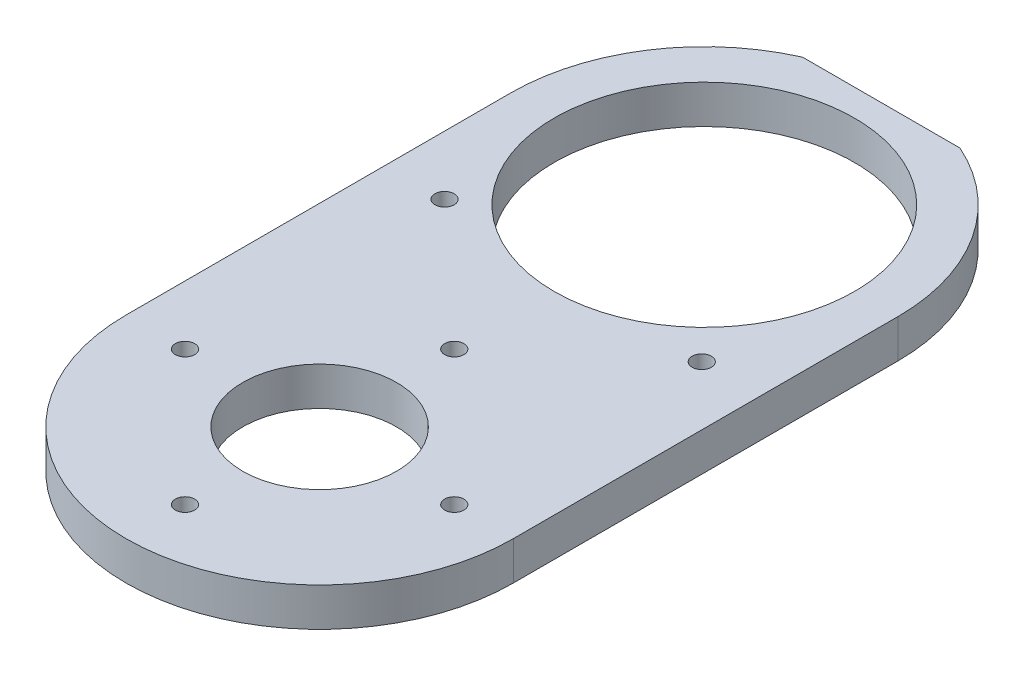
ISO-10303-21;
HEADER;
FILE_DESCRIPTION(('STEP AP214'),'2;1');
FILE_NAME('part.step','',(''),(''),'','','');
FILE_SCHEMA(('AUTOMOTIVE_DESIGN { 1 0 10303 214 1 1 1 1 }'));
ENDSEC;
DATA;
#1=APPLICATION_CONTEXT('core data for automotive mechanical design processes');
#2=APPLICATION_PROTOCOL_DEFINITION('international standard','automotive_design',2000,#1);
#3=PRODUCT_CONTEXT('',#1,'mechanical');
#4=PRODUCT('Part','Part','',(#3));
#5=PRODUCT_RELATED_PRODUCT_CATEGORY('part','',(#4));
#6=PRODUCT_DEFINITION_FORMATION('','',#4);
#7=PRODUCT_DEFINITION_CONTEXT('part definition',#1,'design');
#8=PRODUCT_DEFINITION('design','',#6,#7);
#9=PRODUCT_DEFINITION_SHAPE('','',#8);
#10=(LENGTH_UNIT() NAMED_UNIT(*) SI_UNIT(.MILLI.,.METRE.));
#11=(NAMED_UNIT(*) PLANE_ANGLE_UNIT() SI_UNIT($,.RADIAN.));
#12=(NAMED_UNIT(*) SI_UNIT($,.STERADIAN.) SOLID_ANGLE_UNIT());
#13=UNCERTAINTY_MEASURE_WITH_UNIT(LENGTH_MEASURE(1.E-05),#10,'distance_accuracy_value','');
#14=(GEOMETRIC_REPRESENTATION_CONTEXT(3) GLOBAL_UNCERTAINTY_ASSIGNED_CONTEXT((#13)) GLOBAL_UNIT_ASSIGNED_CONTEXT((#10,
#11,#12)) REPRESENTATION_CONTEXT('',''));
#15=CARTESIAN_POINT('',(0.,0.,0.));
#16=DIRECTION('',(0.,0.,1.));
#17=DIRECTION('',(1.,0.,0.));
#18=AXIS2_PLACEMENT_3D('',#15,#16,#17);
#19=CARTESIAN_POINT('',(0.,12.7,0.));
#20=DIRECTION('',(0.,1.,0.));
#21=DIRECTION('',(0.,0.,1.));
#22=AXIS2_PLACEMENT_3D('',#19,#20,#21);
#23=PLANE('',#22);
#24=CARTESIAN_POINT('',(-44.45,12.7,41.3113329753969));
#25=DIRECTION('',(0.,1.,0.));
#26=DIRECTION('',(0.,0.,1.));
#27=AXIS2_PLACEMENT_3D('',#24,#25,#26);
#28=CIRCLE('',#27,3.175);
#29=CARTESIAN_POINT('',(-44.45,12.7,44.4863329753969));
#30=VERTEX_POINT('',#29);
#31=EDGE_CURVE('E622',#30,#30,#28,.T.);
#32=ORIENTED_EDGE('',*,*,#31,.F.);
#33=EDGE_LOOP('',(#32));
#34=FACE_BOUND('',#33,.T.);
#35=CARTESIAN_POINT('',(44.45,12.7,45.3064469575111));
#36=DIRECTION('',(0.,1.,0.));
#37=DIRECTION('',(0.,0.,1.));
#38=AXIS2_PLACEMENT_3D('',#35,#36,#37);
#39=CIRCLE('',#38,3.175);
#40=CARTESIAN_POINT('',(44.45,12.7,48.4814469575111));
#41=VERTEX_POINT('',#40);
#42=EDGE_CURVE('E629',#41,#41,#39,.T.);
#43=ORIENTED_EDGE('',*,*,#42,.F.);
#44=EDGE_LOOP('',(#43));
#45=FACE_BOUND('',#44,.T.);
#46=CARTESIAN_POINT('',(0.,12.7,82.55));
#47=DIRECTION('',(0.,1.,0.));
#48=DIRECTION('',(0.,0.,1.));
#49=AXIS2_PLACEMENT_3D('',#46,#47,#48);
#50=CIRCLE('',#49,3.175);
#51=CARTESIAN_POINT('',(0.,12.7,85.725));
#52=VERTEX_POINT('',#51);
#53=EDGE_CURVE('E637',#52,#52,#50,.T.);
#54=ORIENTED_EDGE('',*,*,#53,.F.);
#55=EDGE_LOOP('',(#54));
#56=FACE_BOUND('',#55,.T.);
#57=CARTESIAN_POINT('',(-44.45,12.7,127.));
#58=DIRECTION('',(0.,1.,0.));
#59=DIRECTION('',(0.,0.,1.));
#60=AXIS2_PLACEMENT_3D('',#57,#58,#59);
#61=CIRCLE('',#60,3.175);
#62=CARTESIAN_POINT('',(-44.45,12.7,130.175));
#63=VERTEX_POINT('',#62);
#64=EDGE_CURVE('E645',#63,#63,#61,.T.);
#65=ORIENTED_EDGE('',*,*,#64,.F.);
#66=EDGE_LOOP('',(#65));
#67=FACE_BOUND('',#66,.T.);
#68=CARTESIAN_POINT('',(0.,12.7,171.45));
#69=DIRECTION('',(0.,1.,0.));
#70=DIRECTION('',(0.,0.,1.));
#71=AXIS2_PLACEMENT_3D('',#68,#69,#70);
#72=CIRCLE('',#71,3.17500000000001);
#73=CARTESIAN_POINT('',(0.,12.7,174.625));
#74=VERTEX_POINT('',#73);
#75=EDGE_CURVE('E653',#74,#74,#72,.T.);
#76=ORIENTED_EDGE('',*,*,#75,.F.);
#77=EDGE_LOOP('',(#76));
#78=FACE_BOUND('',#77,.T.);
#79=CARTESIAN_POINT('',(44.45,12.7,127.));
#80=DIRECTION('',(0.,1.,0.));
#81=DIRECTION('',(0.,0.,1.));
#82=AXIS2_PLACEMENT_3D('',#79,#80,#81);
#83=CIRCLE('',#82,3.175);
#84=CARTESIAN_POINT('',(44.45,12.7,130.175));
#85=VERTEX_POINT('',#84);
#86=EDGE_CURVE('E657',#85,#85,#83,.T.);
#87=ORIENTED_EDGE('',*,*,#86,.F.);
#88=EDGE_LOOP('',(#87));
#89=FACE_BOUND('',#88,.T.);
#90=CARTESIAN_POINT('',(0.,12.7,0.));
#91=DIRECTION('',(0.,1.,0.));
#92=DIRECTION('',(0.,0.,1.));
#93=AXIS2_PLACEMENT_3D('',#90,#91,#92);
#94=CIRCLE('',#93,49.5875364217784);
#95=CARTESIAN_POINT('',(0.,12.7,49.5875364217784));
#96=VERTEX_POINT('',#95);
#97=EDGE_CURVE('E224',#96,#96,#94,.T.);
#98=ORIENTED_EDGE('',*,*,#97,.F.);
#99=EDGE_LOOP('',(#98));
#100=FACE_BOUND('',#99,.T.);
#101=DIRECTION('',(1.,0.,0.));
#102=VECTOR('',#101,1.);
#103=CARTESIAN_POINT('',(-25.9759730289036,12.7,-58.42));
#104=LINE('',#103,#102);
#105=CARTESIAN_POINT('',(-25.9759730289036,12.7,-58.42));
#106=VERTEX_POINT('',#105);
#107=CARTESIAN_POINT('',(25.9759730289036,12.7,-58.42));
#108=VERTEX_POINT('',#107);
#109=EDGE_CURVE('E369',#106,#108,#104,.T.);
#110=ORIENTED_EDGE('',*,*,#109,.F.);
#111=CARTESIAN_POINT('',(0.,12.7,0.));
#112=DIRECTION('',(0.,1.,0.));
#113=DIRECTION('',(0.,0.,1.));
#114=AXIS2_PLACEMENT_3D('',#111,#112,#113);
#115=CIRCLE('',#114,63.9347133785577);
#116=CARTESIAN_POINT('',(-63.9347133785577,12.7,0.));
#117=VERTEX_POINT('',#116);
#118=EDGE_CURVE('E387',#106,#117,#115,.T.);
#119=ORIENTED_EDGE('',*,*,#118,.T.);
#120=DIRECTION('',(0.,0.,-1.));
#121=VECTOR('',#120,1.);
#122=CARTESIAN_POINT('',(-63.9347133785577,12.7,127.));
#123=LINE('',#122,#121);
#124=CARTESIAN_POINT('',(-63.9347133785577,12.7,127.));
#125=VERTEX_POINT('',#124);
#126=EDGE_CURVE('E383',#125,#117,#123,.T.);
#127=ORIENTED_EDGE('',*,*,#126,.F.);
#128=CARTESIAN_POINT('',(0.,12.7,127.));
#129=DIRECTION('',(0.,1.,0.));
#130=DIRECTION('',(0.,0.,1.));
#131=AXIS2_PLACEMENT_3D('',#128,#129,#130);
#132=CIRCLE('',#131,63.9347133785577);
#133=CARTESIAN_POINT('',(63.9347133785577,12.7,127.));
#134=VERTEX_POINT('',#133);
#135=EDGE_CURVE('E380',#125,#134,#132,.T.);
#136=ORIENTED_EDGE('',*,*,#135,.T.);
#137=DIRECTION('',(0.,0.,-1.));
#138=VECTOR('',#137,1.);
#139=CARTESIAN_POINT('',(63.9347133785577,12.7,127.));
#140=LINE('',#139,#138);
#141=CARTESIAN_POINT('',(63.9347133785577,12.7,0.));
#142=VERTEX_POINT('',#141);
#143=EDGE_CURVE('E377',#134,#142,#140,.T.);
#144=ORIENTED_EDGE('',*,*,#143,.T.);
#145=CARTESIAN_POINT('',(0.,12.7,0.));
#146=DIRECTION('',(0.,1.,0.));
#147=DIRECTION('',(0.,0.,1.));
#148=AXIS2_PLACEMENT_3D('',#145,#146,#147);
#149=CIRCLE('',#148,63.9347133785577);
#150=EDGE_CURVE('E373',#142,#108,#149,.T.);
#151=ORIENTED_EDGE('',*,*,#150,.T.);
#152=EDGE_LOOP('',(#110,#119,#127,#136,#144,#151));
#153=FACE_BOUND('',#152,.T.);
#154=CARTESIAN_POINT('',(0.,12.7,127.));
#155=DIRECTION('',(0.,1.,0.));
#156=DIRECTION('',(0.,0.,1.));
#157=AXIS2_PLACEMENT_3D('',#154,#155,#156);
#158=CIRCLE('',#157,25.4);
#159=CARTESIAN_POINT('',(0.,12.7,152.4));
#160=VERTEX_POINT('',#159);
#161=EDGE_CURVE('E672',#160,#160,#158,.T.);
#162=ORIENTED_EDGE('',*,*,#161,.F.);
#163=EDGE_LOOP('',(#162));
#164=FACE_BOUND('',#163,.T.);
#165=ADVANCED_FACE('F37',(#34,#45,#56,#67,#78,#89,#100,#153,#164),#23,.T.);
#166=CARTESIAN_POINT('',(0.,0.,0.));
#167=DIRECTION('',(0.,1.,0.));
#168=DIRECTION('',(0.,0.,1.));
#169=AXIS2_PLACEMENT_3D('',#166,#167,#168);
#170=PLANE('',#169);
#171=CARTESIAN_POINT('',(0.,0.,0.));
#172=DIRECTION('',(0.,1.,0.));
#173=DIRECTION('',(0.,0.,1.));
#174=AXIS2_PLACEMENT_3D('',#171,#172,#173);
#175=CIRCLE('',#174,49.5875364217784);
#176=CARTESIAN_POINT('',(0.,0.,49.5875364217784));
#177=VERTEX_POINT('',#176);
#178=EDGE_CURVE('E675',#177,#177,#175,.T.);
#179=ORIENTED_EDGE('',*,*,#178,.T.);
#180=EDGE_LOOP('',(#179));
#181=FACE_BOUND('',#180,.T.);
#182=DIRECTION('',(0.,0.,-1.));
#183=VECTOR('',#182,1.);
#184=CARTESIAN_POINT('',(-54.0287133785577,0.,0.));
#185=LINE('',#184,#183);
#186=CARTESIAN_POINT('',(-54.0287133785577,0.,127.));
#187=VERTEX_POINT('',#186);
#188=CARTESIAN_POINT('',(-54.0287133785577,0.,0.));
#189=VERTEX_POINT('',#188);
#190=EDGE_CURVE('E215',#187,#189,#185,.T.);
#191=ORIENTED_EDGE('',*,*,#190,.T.);
#192=CARTESIAN_POINT('',(0.,0.,0.));
#193=DIRECTION('',(0.,1.,0.));
#194=DIRECTION('',(0.,0.,1.));
#195=AXIS2_PLACEMENT_3D('',#192,#193,#194);
#196=CIRCLE('',#195,54.0287133785577);
#197=CARTESIAN_POINT('',(-25.7168339573919,0.,-47.5157481320696));
#198=VERTEX_POINT('',#197);
#199=EDGE_CURVE('E63',#198,#189,#196,.T.);
#200=ORIENTED_EDGE('',*,*,#199,.F.);
#201=CARTESIAN_POINT('',(-13.62682585483,0.,-25.1776259173446));
#202=DIRECTION('',(0.,1.,0.));
#203=DIRECTION('',(0.,0.,1.));
#204=AXIS2_PLACEMENT_3D('',#201,#202,#203);
#205=CIRCLE('',#204,25.4);
#206=CARTESIAN_POINT('',(-13.62682585483,0.,-50.5776259173446));
#207=VERTEX_POINT('',#206);
#208=EDGE_CURVE('E302',#198,#207,#205,.F.);
#209=ORIENTED_EDGE('',*,*,#208,.T.);
#210=DIRECTION('',(1.,0.,0.));
#211=VECTOR('',#210,1.);
#212=CARTESIAN_POINT('',(0.,0.,-50.5776259173446));
#213=LINE('',#212,#211);
#214=CARTESIAN_POINT('',(13.6268258548301,0.,-50.5776259173446));
#215=VERTEX_POINT('',#214);
#216=EDGE_CURVE('E306',#207,#215,#213,.T.);
#217=ORIENTED_EDGE('',*,*,#216,.T.);
#218=CARTESIAN_POINT('',(13.6268258548301,0.,-25.1776259173446));
#219=DIRECTION('',(0.,1.,0.));
#220=DIRECTION('',(0.,0.,1.));
#221=AXIS2_PLACEMENT_3D('',#218,#219,#220);
#222=CIRCLE('',#221,25.4);
#223=CARTESIAN_POINT('',(25.7168339573919,0.,-47.5157481320696));
#224=VERTEX_POINT('',#223);
#225=EDGE_CURVE('E310',#224,#215,#222,.T.);
#226=ORIENTED_EDGE('',*,*,#225,.F.);
#227=CARTESIAN_POINT('',(0.,0.,0.));
#228=DIRECTION('',(0.,1.,0.));
#229=DIRECTION('',(0.,0.,1.));
#230=AXIS2_PLACEMENT_3D('',#227,#228,#229);
#231=CIRCLE('',#230,54.0287133785577);
#232=CARTESIAN_POINT('',(54.0287133785577,0.,0.));
#233=VERTEX_POINT('',#232);
#234=EDGE_CURVE('E314',#233,#224,#231,.T.);
#235=ORIENTED_EDGE('',*,*,#234,.F.);
#236=DIRECTION('',(0.,0.,-1.));
#237=VECTOR('',#236,1.);
#238=CARTESIAN_POINT('',(54.0287133785577,0.,0.));
#239=LINE('',#238,#237);
#240=CARTESIAN_POINT('',(54.0287133785577,0.,127.));
#241=VERTEX_POINT('',#240);
#242=EDGE_CURVE('E318',#241,#233,#239,.T.);
#243=ORIENTED_EDGE('',*,*,#242,.F.);
#244=CARTESIAN_POINT('',(0.,0.,127.));
#245=DIRECTION('',(0.,1.,0.));
#246=DIRECTION('',(0.,0.,1.));
#247=AXIS2_PLACEMENT_3D('',#244,#245,#246);
#248=CIRCLE('',#247,54.0287133785577);
#249=EDGE_CURVE('E221',#187,#241,#248,.T.);
#250=ORIENTED_EDGE('',*,*,#249,.F.);
#251=EDGE_LOOP('',(#191,#200,#209,#217,#226,#235,#243,#250));
#252=FACE_BOUND('',#251,.T.);
#253=CARTESIAN_POINT('',(0.,0.,127.));
#254=DIRECTION('',(0.,1.,0.));
#255=DIRECTION('',(0.,0.,1.));
#256=AXIS2_PLACEMENT_3D('',#253,#254,#255);
#257=CIRCLE('',#256,25.4);
#258=CARTESIAN_POINT('',(0.,0.,152.4));
#259=VERTEX_POINT('',#258);
#260=EDGE_CURVE('E665',#259,#259,#257,.T.);
#261=ORIENTED_EDGE('',*,*,#260,.T.);
#262=EDGE_LOOP('',(#261));
#263=FACE_BOUND('',#262,.T.);
#264=ADVANCED_FACE('F462',(#181,#252,#263),#170,.F.);
#265=CARTESIAN_POINT('',(15.5469078192639,0.,-30.7656259173446));
#266=DIRECTION('',(0.,1.,0.));
#267=DIRECTION('',(0.,0.,1.));
#268=AXIS2_PLACEMENT_3D('',#265,#266,#267);
#269=CIRCLE('',#268,25.4);
#270=CARTESIAN_POINT('',(15.5469078192639,0.,-56.1656259173446));
#271=VERTEX_POINT('',#270);
#272=CARTESIAN_POINT('',(27.0027617864448,0.,-53.435504829298));
#273=VERTEX_POINT('',#272);
#274=EDGE_CURVE('E296',#271,#273,#269,.F.);
#275=ORIENTED_EDGE('',*,*,#274,.F.);
#276=DIRECTION('',(1.,0.,0.));
#277=VECTOR('',#276,1.);
#278=CARTESIAN_POINT('',(0.,0.,-56.1656259173446));
#279=LINE('',#278,#277);
#280=CARTESIAN_POINT('',(-15.5469078192639,0.,-56.1656259173446));
#281=VERTEX_POINT('',#280);
#282=EDGE_CURVE('E55',#281,#271,#279,.T.);
#283=ORIENTED_EDGE('',*,*,#282,.F.);
#284=CARTESIAN_POINT('',(-15.5469078192639,0.,-30.7656259173446));
#285=DIRECTION('',(0.,1.,0.));
#286=DIRECTION('',(0.,0.,1.));
#287=AXIS2_PLACEMENT_3D('',#284,#285,#286);
#288=CIRCLE('',#287,25.4);
#289=CARTESIAN_POINT('',(-27.0027617864447,0.,-53.435504829298));
#290=VERTEX_POINT('',#289);
#291=EDGE_CURVE('E194',#281,#290,#288,.T.);
#292=ORIENTED_EDGE('',*,*,#291,.T.);
#293=CARTESIAN_POINT('',(0.,0.,0.));
#294=DIRECTION('',(0.,1.,0.));
#295=DIRECTION('',(0.,0.,1.));
#296=AXIS2_PLACEMENT_3D('',#293,#294,#295);
#297=CIRCLE('',#296,59.8707133785577);
#298=CARTESIAN_POINT('',(-59.8707133785577,0.,0.));
#299=VERTEX_POINT('',#298);
#300=EDGE_CURVE('E276',#290,#299,#297,.T.);
#301=ORIENTED_EDGE('',*,*,#300,.T.);
#302=DIRECTION('',(0.,0.,-1.));
#303=VECTOR('',#302,1.);
#304=CARTESIAN_POINT('',(-59.8707133785577,0.,0.));
#305=LINE('',#304,#303);
#306=CARTESIAN_POINT('',(-59.8707133785577,0.,127.));
#307=VERTEX_POINT('',#306);
#308=EDGE_CURVE('E280',#307,#299,#305,.T.);
#309=ORIENTED_EDGE('',*,*,#308,.F.);
#310=CARTESIAN_POINT('',(0.,0.,127.));
#311=DIRECTION('',(0.,1.,0.));
#312=DIRECTION('',(0.,0.,1.));
#313=AXIS2_PLACEMENT_3D('',#310,#311,#312);
#314=CIRCLE('',#313,59.8707133785577);
#315=CARTESIAN_POINT('',(59.8707133785577,0.,127.));
#316=VERTEX_POINT('',#315);
#317=EDGE_CURVE('E284',#307,#316,#314,.T.);
#318=ORIENTED_EDGE('',*,*,#317,.T.);
#319=DIRECTION('',(0.,0.,-1.));
#320=VECTOR('',#319,1.);
#321=CARTESIAN_POINT('',(59.8707133785577,0.,0.));
#322=LINE('',#321,#320);
#323=CARTESIAN_POINT('',(59.8707133785577,0.,0.));
#324=VERTEX_POINT('',#323);
#325=EDGE_CURVE('E288',#316,#324,#322,.T.);
#326=ORIENTED_EDGE('',*,*,#325,.T.);
#327=CARTESIAN_POINT('',(0.,0.,0.));
#328=DIRECTION('',(0.,1.,0.));
#329=DIRECTION('',(0.,0.,1.));
#330=AXIS2_PLACEMENT_3D('',#327,#328,#329);
#331=CIRCLE('',#330,59.8707133785577);
#332=EDGE_CURVE('E292',#324,#273,#331,.T.);
#333=ORIENTED_EDGE('',*,*,#332,.T.);
#334=EDGE_LOOP('',(#275,#283,#292,#301,#309,#318,#326,#333));
#335=FACE_BOUND('',#334,.T.);
#336=DIRECTION('',(1.,0.,0.));
#337=VECTOR('',#336,1.);
#338=CARTESIAN_POINT('',(-25.9759730289036,0.,-58.42));
#339=LINE('',#338,#337);
#340=CARTESIAN_POINT('',(-25.9759730289036,0.,-58.42));
#341=VERTEX_POINT('',#340);
#342=CARTESIAN_POINT('',(25.9759730289036,0.,-58.42));
#343=VERTEX_POINT('',#342);
#344=EDGE_CURVE('E349',#341,#343,#339,.T.);
#345=ORIENTED_EDGE('',*,*,#344,.T.);
#346=CARTESIAN_POINT('',(0.,0.,0.));
#347=DIRECTION('',(0.,1.,0.));
#348=DIRECTION('',(0.,0.,1.));
#349=AXIS2_PLACEMENT_3D('',#346,#347,#348);
#350=CIRCLE('',#349,63.9347133785577);
#351=CARTESIAN_POINT('',(63.9347133785577,0.,0.));
#352=VERTEX_POINT('',#351);
#353=EDGE_CURVE('E393',#352,#343,#350,.T.);
#354=ORIENTED_EDGE('',*,*,#353,.F.);
#355=DIRECTION('',(0.,0.,-1.));
#356=VECTOR('',#355,1.);
#357=CARTESIAN_POINT('',(63.9347133785577,0.,127.));
#358=LINE('',#357,#356);
#359=CARTESIAN_POINT('',(63.9347133785577,0.,127.));
#360=VERTEX_POINT('',#359);
#361=EDGE_CURVE('E397',#360,#352,#358,.T.);
#362=ORIENTED_EDGE('',*,*,#361,.F.);
#363=CARTESIAN_POINT('',(0.,0.,127.));
#364=DIRECTION('',(0.,1.,0.));
#365=DIRECTION('',(0.,0.,1.));
#366=AXIS2_PLACEMENT_3D('',#363,#364,#365);
#367=CIRCLE('',#366,63.9347133785577);
#368=CARTESIAN_POINT('',(-63.9347133785577,0.,127.));
#369=VERTEX_POINT('',#368);
#370=EDGE_CURVE('E400',#369,#360,#367,.T.);
#371=ORIENTED_EDGE('',*,*,#370,.F.);
#372=DIRECTION('',(0.,0.,-1.));
#373=VECTOR('',#372,1.);
#374=CARTESIAN_POINT('',(-63.9347133785577,0.,127.));
#375=LINE('',#374,#373);
#376=CARTESIAN_POINT('',(-63.9347133785577,0.,0.));
#377=VERTEX_POINT('',#376);
#378=EDGE_CURVE('E403',#369,#377,#375,.T.);
#379=ORIENTED_EDGE('',*,*,#378,.T.);
#380=CARTESIAN_POINT('',(0.,0.,0.));
#381=DIRECTION('',(0.,1.,0.));
#382=DIRECTION('',(0.,0.,1.));
#383=AXIS2_PLACEMENT_3D('',#380,#381,#382);
#384=CIRCLE('',#383,63.9347133785577);
#385=EDGE_CURVE('E374',#341,#377,#384,.T.);
#386=ORIENTED_EDGE('',*,*,#385,.F.);
#387=EDGE_LOOP('',(#345,#354,#362,#371,#379,#386));
#388=FACE_BOUND('',#387,.T.);
#389=ADVANCED_FACE('F434',(#335,#388),#170,.F.);
#390=CARTESIAN_POINT('',(-25.9759730289036,12.7,-58.42));
#391=DIRECTION('',(0.,0.,-1.));
#392=DIRECTION('',(-1.,0.,0.));
#393=AXIS2_PLACEMENT_3D('',#390,#391,#392);
#394=PLANE('',#393);
#395=ORIENTED_EDGE('',*,*,#344,.F.);
#396=DIRECTION('',(0.,-1.,0.));
#397=VECTOR('',#396,1.);
#398=CARTESIAN_POINT('',(-25.9759730289036,12.7,-58.42));
#399=LINE('',#398,#397);
#400=EDGE_CURVE('E11',#106,#341,#399,.T.);
#401=ORIENTED_EDGE('',*,*,#400,.F.);
#402=ORIENTED_EDGE('',*,*,#109,.T.);
#403=DIRECTION('',(0.,-1.,0.));
#404=VECTOR('',#403,1.);
#405=CARTESIAN_POINT('',(25.9759730289036,12.7,-58.42));
#406=LINE('',#405,#404);
#407=EDGE_CURVE('E41',#108,#343,#406,.T.);
#408=ORIENTED_EDGE('',*,*,#407,.T.);
#409=EDGE_LOOP('',(#395,#401,#402,#408));
#410=FACE_BOUND('',#409,.T.);
#411=ADVANCED_FACE('F39',(#410),#394,.T.);
#412=CARTESIAN_POINT('',(0.,12.7,0.));
#413=DIRECTION('',(0.,-1.,0.));
#414=DIRECTION('',(0.,0.,-1.));
#415=AXIS2_PLACEMENT_3D('',#412,#413,#414);
#416=CYLINDRICAL_SURFACE('',#415,63.9347133785577);
#417=ORIENTED_EDGE('',*,*,#385,.T.);
#418=DIRECTION('',(0.,-1.,0.));
#419=VECTOR('',#418,1.);
#420=CARTESIAN_POINT('',(-63.9347133785577,12.7,0.));
#421=LINE('',#420,#419);
#422=EDGE_CURVE('E47',#117,#377,#421,.T.);
#423=ORIENTED_EDGE('',*,*,#422,.F.);
#424=ORIENTED_EDGE('',*,*,#118,.F.);
#425=ORIENTED_EDGE('',*,*,#400,.T.);
#426=EDGE_LOOP('',(#417,#423,#424,#425));
#427=FACE_BOUND('',#426,.T.);
#428=ADVANCED_FACE('F439',(#427),#416,.T.);
#429=CARTESIAN_POINT('',(-63.9347133785577,12.7,127.));
#430=DIRECTION('',(-1.,0.,0.));
#431=DIRECTION('',(0.,0.,1.));
#432=AXIS2_PLACEMENT_3D('',#429,#430,#431);
#433=PLANE('',#432);
#434=ORIENTED_EDGE('',*,*,#378,.F.);
#435=DIRECTION('',(0.,-1.,0.));
#436=VECTOR('',#435,1.);
#437=CARTESIAN_POINT('',(-63.9347133785577,12.7,127.));
#438=LINE('',#437,#436);
#439=EDGE_CURVE('E412',#125,#369,#438,.T.);
#440=ORIENTED_EDGE('',*,*,#439,.F.);
#441=ORIENTED_EDGE('',*,*,#126,.T.);
#442=ORIENTED_EDGE('',*,*,#422,.T.);
#443=EDGE_LOOP('',(#434,#440,#441,#442));
#444=FACE_BOUND('',#443,.T.);
#445=ADVANCED_FACE('F451',(#444),#433,.T.);
#446=CARTESIAN_POINT('',(0.,12.7,127.));
#447=DIRECTION('',(0.,-1.,0.));
#448=DIRECTION('',(0.,0.,-1.));
#449=AXIS2_PLACEMENT_3D('',#446,#447,#448);
#450=CYLINDRICAL_SURFACE('',#449,63.9347133785577);
#451=ORIENTED_EDGE('',*,*,#370,.T.);
#452=DIRECTION('',(0.,-1.,0.));
#453=VECTOR('',#452,1.);
#454=CARTESIAN_POINT('',(63.9347133785577,12.7,127.));
#455=LINE('',#454,#453);
#456=EDGE_CURVE('E415',#134,#360,#455,.T.);
#457=ORIENTED_EDGE('',*,*,#456,.F.);
#458=ORIENTED_EDGE('',*,*,#135,.F.);
#459=ORIENTED_EDGE('',*,*,#439,.T.);
#460=EDGE_LOOP('',(#451,#457,#458,#459));
#461=FACE_BOUND('',#460,.T.);
#462=ADVANCED_FACE('F452',(#461),#450,.T.);
#463=CARTESIAN_POINT('',(63.9347133785577,12.7,127.));
#464=DIRECTION('',(-1.,0.,0.));
#465=DIRECTION('',(0.,0.,1.));
#466=AXIS2_PLACEMENT_3D('',#463,#464,#465);
#467=PLANE('',#466);
#468=ORIENTED_EDGE('',*,*,#361,.T.);
#469=DIRECTION('',(0.,-1.,0.));
#470=VECTOR('',#469,1.);
#471=CARTESIAN_POINT('',(63.9347133785577,12.7,0.));
#472=LINE('',#471,#470);
#473=EDGE_CURVE('E418',#142,#352,#472,.T.);
#474=ORIENTED_EDGE('',*,*,#473,.F.);
#475=ORIENTED_EDGE('',*,*,#143,.F.);
#476=ORIENTED_EDGE('',*,*,#456,.T.);
#477=EDGE_LOOP('',(#468,#474,#475,#476));
#478=FACE_BOUND('',#477,.T.);
#479=ADVANCED_FACE('F448',(#478),#467,.F.);
#480=CARTESIAN_POINT('',(0.,12.7,0.));
#481=DIRECTION('',(0.,-1.,0.));
#482=DIRECTION('',(0.,0.,-1.));
#483=AXIS2_PLACEMENT_3D('',#480,#481,#482);
#484=CYLINDRICAL_SURFACE('',#483,63.9347133785577);
#485=ORIENTED_EDGE('',*,*,#353,.T.);
#486=ORIENTED_EDGE('',*,*,#407,.F.);
#487=ORIENTED_EDGE('',*,*,#150,.F.);
#488=ORIENTED_EDGE('',*,*,#473,.T.);
#489=EDGE_LOOP('',(#485,#486,#487,#488));
#490=FACE_BOUND('',#489,.T.);
#491=ADVANCED_FACE('F430',(#490),#484,.T.);
#492=CARTESIAN_POINT('',(0.,5.588,0.));
#493=DIRECTION('',(0.,-1.,0.));
#494=DIRECTION('',(0.,0.,-1.));
#495=AXIS2_PLACEMENT_3D('',#492,#493,#494);
#496=CYLINDRICAL_SURFACE('',#495,54.0287133785577);
#497=ORIENTED_EDGE('',*,*,#199,.T.);
#498=DIRECTION('',(0.,-1.,0.));
#499=VECTOR('',#498,1.);
#500=CARTESIAN_POINT('',(-54.0287133785577,5.588,0.));
#501=LINE('',#500,#499);
#502=CARTESIAN_POINT('',(-54.0287133785577,5.588,0.));
#503=VERTEX_POINT('',#502);
#504=EDGE_CURVE('E197',#503,#189,#501,.T.);
#505=ORIENTED_EDGE('',*,*,#504,.F.);
#506=CARTESIAN_POINT('',(0.,5.588,0.));
#507=DIRECTION('',(0.,1.,0.));
#508=DIRECTION('',(0.,0.,1.));
#509=AXIS2_PLACEMENT_3D('',#506,#507,#508);
#510=CIRCLE('',#509,54.0287133785577);
#511=CARTESIAN_POINT('',(-25.7168339573919,5.588,-47.5157481320696));
#512=VERTEX_POINT('',#511);
#513=EDGE_CURVE('E244',#512,#503,#510,.T.);
#514=ORIENTED_EDGE('',*,*,#513,.F.);
#515=DIRECTION('',(0.,-1.,0.));
#516=VECTOR('',#515,1.);
#517=CARTESIAN_POINT('',(-25.7168339573919,5.588,-47.5157481320696));
#518=LINE('',#517,#516);
#519=EDGE_CURVE('E346',#512,#198,#518,.T.);
#520=ORIENTED_EDGE('',*,*,#519,.T.);
#521=EDGE_LOOP('',(#497,#505,#514,#520));
#522=FACE_BOUND('',#521,.T.);
#523=ADVANCED_FACE('F528',(#522),#496,.T.);
#524=CARTESIAN_POINT('',(-13.62682585483,5.588,-25.1776259173446));
#525=DIRECTION('',(0.,-1.,0.));
#526=DIRECTION('',(0.,0.,-1.));
#527=AXIS2_PLACEMENT_3D('',#524,#525,#526);
#528=CYLINDRICAL_SURFACE('',#527,25.4);
#529=ORIENTED_EDGE('',*,*,#208,.F.);
#530=ORIENTED_EDGE('',*,*,#519,.F.);
#531=CARTESIAN_POINT('',(-13.62682585483,5.588,-25.1776259173446));
#532=DIRECTION('',(0.,1.,0.));
#533=DIRECTION('',(0.,0.,1.));
#534=AXIS2_PLACEMENT_3D('',#531,#532,#533);
#535=CIRCLE('',#534,25.4);
#536=CARTESIAN_POINT('',(-13.62682585483,5.588,-50.5776259173446));
#537=VERTEX_POINT('',#536);
#538=EDGE_CURVE('E248',#512,#537,#535,.F.);
#539=ORIENTED_EDGE('',*,*,#538,.T.);
#540=DIRECTION('',(0.,-1.,0.));
#541=VECTOR('',#540,1.);
#542=CARTESIAN_POINT('',(-13.62682585483,5.588,-50.5776259173446));
#543=LINE('',#542,#541);
#544=EDGE_CURVE('E342',#537,#207,#543,.T.);
#545=ORIENTED_EDGE('',*,*,#544,.T.);
#546=EDGE_LOOP('',(#529,#530,#539,#545));
#547=FACE_BOUND('',#546,.T.);
#548=ADVANCED_FACE('F531',(#547),#528,.T.);
#549=CARTESIAN_POINT('',(0.,5.588,-50.5776259173446));
#550=DIRECTION('',(0.,0.,-1.));
#551=DIRECTION('',(-1.,0.,0.));
#552=AXIS2_PLACEMENT_3D('',#549,#550,#551);
#553=PLANE('',#552);
#554=ORIENTED_EDGE('',*,*,#216,.F.);
#555=ORIENTED_EDGE('',*,*,#544,.F.);
#556=DIRECTION('',(1.,0.,0.));
#557=VECTOR('',#556,1.);
#558=CARTESIAN_POINT('',(0.,5.588,-50.5776259173446));
#559=LINE('',#558,#557);
#560=CARTESIAN_POINT('',(13.6268258548301,5.588,-50.5776259173446));
#561=VERTEX_POINT('',#560);
#562=EDGE_CURVE('E251',#537,#561,#559,.T.);
#563=ORIENTED_EDGE('',*,*,#562,.T.);
#564=DIRECTION('',(0.,-1.,0.));
#565=VECTOR('',#564,1.);
#566=CARTESIAN_POINT('',(13.6268258548301,5.588,-50.5776259173446));
#567=LINE('',#566,#565);
#568=EDGE_CURVE('E339',#561,#215,#567,.T.);
#569=ORIENTED_EDGE('',*,*,#568,.T.);
#570=EDGE_LOOP('',(#554,#555,#563,#569));
#571=FACE_BOUND('',#570,.T.);
#572=ADVANCED_FACE('F534',(#571),#553,.T.);
#573=CARTESIAN_POINT('',(13.6268258548301,5.588,-25.1776259173446));
#574=DIRECTION('',(0.,-1.,0.));
#575=DIRECTION('',(0.,0.,-1.));
#576=AXIS2_PLACEMENT_3D('',#573,#574,#575);
#577=CYLINDRICAL_SURFACE('',#576,25.4);
#578=ORIENTED_EDGE('',*,*,#225,.T.);
#579=ORIENTED_EDGE('',*,*,#568,.F.);
#580=CARTESIAN_POINT('',(13.6268258548301,5.588,-25.1776259173446));
#581=DIRECTION('',(0.,1.,0.));
#582=DIRECTION('',(0.,0.,1.));
#583=AXIS2_PLACEMENT_3D('',#580,#581,#582);
#584=CIRCLE('',#583,25.4);
#585=CARTESIAN_POINT('',(25.7168339573919,5.588,-47.5157481320696));
#586=VERTEX_POINT('',#585);
#587=EDGE_CURVE('E254',#586,#561,#584,.T.);
#588=ORIENTED_EDGE('',*,*,#587,.F.);
#589=DIRECTION('',(0.,-1.,0.));
#590=VECTOR('',#589,1.);
#591=CARTESIAN_POINT('',(25.7168339573919,5.588,-47.5157481320696));
#592=LINE('',#591,#590);
#593=EDGE_CURVE('E336',#586,#224,#592,.T.);
#594=ORIENTED_EDGE('',*,*,#593,.T.);
#595=EDGE_LOOP('',(#578,#579,#588,#594));
#596=FACE_BOUND('',#595,.T.);
#597=ADVANCED_FACE('F538',(#596),#577,.T.);
#598=CARTESIAN_POINT('',(0.,5.588,0.));
#599=DIRECTION('',(0.,-1.,0.));
#600=DIRECTION('',(0.,0.,-1.));
#601=AXIS2_PLACEMENT_3D('',#598,#599,#600);
#602=CYLINDRICAL_SURFACE('',#601,54.0287133785577);
#603=ORIENTED_EDGE('',*,*,#234,.T.);
#604=ORIENTED_EDGE('',*,*,#593,.F.);
#605=CARTESIAN_POINT('',(0.,5.588,0.));
#606=DIRECTION('',(0.,1.,0.));
#607=DIRECTION('',(0.,0.,1.));
#608=AXIS2_PLACEMENT_3D('',#605,#606,#607);
#609=CIRCLE('',#608,54.0287133785577);
#610=CARTESIAN_POINT('',(54.0287133785577,5.588,0.));
#611=VERTEX_POINT('',#610);
#612=EDGE_CURVE('E258',#611,#586,#609,.T.);
#613=ORIENTED_EDGE('',*,*,#612,.F.);
#614=DIRECTION('',(0.,-1.,0.));
#615=VECTOR('',#614,1.);
#616=CARTESIAN_POINT('',(54.0287133785577,5.588,0.));
#617=LINE('',#616,#615);
#618=EDGE_CURVE('E333',#611,#233,#617,.T.);
#619=ORIENTED_EDGE('',*,*,#618,.T.);
#620=EDGE_LOOP('',(#603,#604,#613,#619));
#621=FACE_BOUND('',#620,.T.);
#622=ADVANCED_FACE('F542',(#621),#602,.T.);
#623=CARTESIAN_POINT('',(54.0287133785577,5.588,0.));
#624=DIRECTION('',(-1.,0.,0.));
#625=DIRECTION('',(0.,0.,1.));
#626=AXIS2_PLACEMENT_3D('',#623,#624,#625);
#627=PLANE('',#626);
#628=ORIENTED_EDGE('',*,*,#242,.T.);
#629=ORIENTED_EDGE('',*,*,#618,.F.);
#630=DIRECTION('',(0.,0.,-1.));
#631=VECTOR('',#630,1.);
#632=CARTESIAN_POINT('',(54.0287133785577,5.588,0.));
#633=LINE('',#632,#631);
#634=CARTESIAN_POINT('',(54.0287133785577,5.588,127.));
#635=VERTEX_POINT('',#634);
#636=EDGE_CURVE('E262',#635,#611,#633,.T.);
#637=ORIENTED_EDGE('',*,*,#636,.F.);
#638=DIRECTION('',(0.,-1.,0.));
#639=VECTOR('',#638,1.);
#640=CARTESIAN_POINT('',(54.0287133785577,5.588,127.));
#641=LINE('',#640,#639);
#642=EDGE_CURVE('E330',#635,#241,#641,.T.);
#643=ORIENTED_EDGE('',*,*,#642,.T.);
#644=EDGE_LOOP('',(#628,#629,#637,#643));
#645=FACE_BOUND('',#644,.T.);
#646=ADVANCED_FACE('F546',(#645),#627,.F.);
#647=CARTESIAN_POINT('',(0.,5.588,127.));
#648=DIRECTION('',(0.,-1.,0.));
#649=DIRECTION('',(0.,0.,-1.));
#650=AXIS2_PLACEMENT_3D('',#647,#648,#649);
#651=CYLINDRICAL_SURFACE('',#650,54.0287133785577);
#652=ORIENTED_EDGE('',*,*,#249,.T.);
#653=ORIENTED_EDGE('',*,*,#642,.F.);
#654=CARTESIAN_POINT('',(0.,5.588,127.));
#655=DIRECTION('',(0.,1.,0.));
#656=DIRECTION('',(0.,0.,1.));
#657=AXIS2_PLACEMENT_3D('',#654,#655,#656);
#658=CIRCLE('',#657,54.0287133785577);
#659=CARTESIAN_POINT('',(-54.0287133785577,5.588,127.));
#660=VERTEX_POINT('',#659);
#661=EDGE_CURVE('E266',#660,#635,#658,.T.);
#662=ORIENTED_EDGE('',*,*,#661,.F.);
#663=DIRECTION('',(0.,-1.,0.));
#664=VECTOR('',#663,1.);
#665=CARTESIAN_POINT('',(-54.0287133785577,5.588,127.));
#666=LINE('',#665,#664);
#667=EDGE_CURVE('E327',#660,#187,#666,.T.);
#668=ORIENTED_EDGE('',*,*,#667,.T.);
#669=EDGE_LOOP('',(#652,#653,#662,#668));
#670=FACE_BOUND('',#669,.T.);
#671=ADVANCED_FACE('F550',(#670),#651,.T.);
#672=CARTESIAN_POINT('',(0.,5.588,-56.1656259173446));
#673=DIRECTION('',(0.,0.,-1.));
#674=DIRECTION('',(-1.,0.,0.));
#675=AXIS2_PLACEMENT_3D('',#672,#673,#674);
#676=PLANE('',#675);
#677=ORIENTED_EDGE('',*,*,#282,.T.);
#678=DIRECTION('',(0.,-1.,0.));
#679=VECTOR('',#678,1.);
#680=CARTESIAN_POINT('',(15.5469078192639,5.588,-56.1656259173446));
#681=LINE('',#680,#679);
#682=CARTESIAN_POINT('',(15.5469078192639,5.588,-56.1656259173446));
#683=VERTEX_POINT('',#682);
#684=EDGE_CURVE('E213',#683,#271,#681,.T.);
#685=ORIENTED_EDGE('',*,*,#684,.F.);
#686=DIRECTION('',(1.,0.,0.));
#687=VECTOR('',#686,1.);
#688=CARTESIAN_POINT('',(0.,5.588,-56.1656259173446));
#689=LINE('',#688,#687);
#690=CARTESIAN_POINT('',(-15.5469078192639,5.588,-56.1656259173446));
#691=VERTEX_POINT('',#690);
#692=EDGE_CURVE('E206',#691,#683,#689,.T.);
#693=ORIENTED_EDGE('',*,*,#692,.F.);
#694=DIRECTION('',(0.,-1.,0.));
#695=VECTOR('',#694,1.);
#696=CARTESIAN_POINT('',(-15.5469078192639,5.588,-56.1656259173446));
#697=LINE('',#696,#695);
#698=EDGE_CURVE('E188',#691,#281,#697,.T.);
#699=ORIENTED_EDGE('',*,*,#698,.T.);
#700=EDGE_LOOP('',(#677,#685,#693,#699));
#701=FACE_BOUND('',#700,.T.);
#702=ADVANCED_FACE('F212',(#701),#676,.F.);
#703=CARTESIAN_POINT('',(-15.5469078192639,5.588,-30.7656259173446));
#704=DIRECTION('',(0.,-1.,0.));
#705=DIRECTION('',(0.,0.,-1.));
#706=AXIS2_PLACEMENT_3D('',#703,#704,#705);
#707=CYLINDRICAL_SURFACE('',#706,25.4);
#708=ORIENTED_EDGE('',*,*,#291,.F.);
#709=ORIENTED_EDGE('',*,*,#698,.F.);
#710=CARTESIAN_POINT('',(-15.5469078192639,5.588,-30.7656259173446));
#711=DIRECTION('',(0.,1.,0.));
#712=DIRECTION('',(0.,0.,1.));
#713=AXIS2_PLACEMENT_3D('',#710,#711,#712);
#714=CIRCLE('',#713,25.4);
#715=CARTESIAN_POINT('',(-27.0027617864447,5.588,-53.435504829298));
#716=VERTEX_POINT('',#715);
#717=EDGE_CURVE('E191',#691,#716,#714,.T.);
#718=ORIENTED_EDGE('',*,*,#717,.T.);
#719=DIRECTION('',(0.,-1.,0.));
#720=VECTOR('',#719,1.);
#721=CARTESIAN_POINT('',(-27.0027617864447,5.588,-53.435504829298));
#722=LINE('',#721,#720);
#723=EDGE_CURVE('E198',#716,#290,#722,.T.);
#724=ORIENTED_EDGE('',*,*,#723,.T.);
#725=EDGE_LOOP('',(#708,#709,#718,#724));
#726=FACE_BOUND('',#725,.T.);
#727=ADVANCED_FACE('F190',(#726),#707,.F.);
#728=CARTESIAN_POINT('',(0.,5.588,0.));
#729=DIRECTION('',(0.,-1.,0.));
#730=DIRECTION('',(0.,0.,-1.));
#731=AXIS2_PLACEMENT_3D('',#728,#729,#730);
#732=CYLINDRICAL_SURFACE('',#731,59.8707133785577);
#733=ORIENTED_EDGE('',*,*,#300,.F.);
#734=ORIENTED_EDGE('',*,*,#723,.F.);
#735=CARTESIAN_POINT('',(0.,5.588,0.));
#736=DIRECTION('',(0.,1.,0.));
#737=DIRECTION('',(0.,0.,1.));
#738=AXIS2_PLACEMENT_3D('',#735,#736,#737);
#739=CIRCLE('',#738,59.8707133785577);
#740=CARTESIAN_POINT('',(-59.8707133785577,5.588,0.));
#741=VERTEX_POINT('',#740);
#742=EDGE_CURVE('E209',#716,#741,#739,.T.);
#743=ORIENTED_EDGE('',*,*,#742,.T.);
#744=DIRECTION('',(0.,-1.,0.));
#745=VECTOR('',#744,1.);
#746=CARTESIAN_POINT('',(-59.8707133785577,5.588,0.));
#747=LINE('',#746,#745);
#748=EDGE_CURVE('E364',#741,#299,#747,.T.);
#749=ORIENTED_EDGE('',*,*,#748,.T.);
#750=EDGE_LOOP('',(#733,#734,#743,#749));
#751=FACE_BOUND('',#750,.T.);
#752=ADVANCED_FACE('F510',(#751),#732,.F.);
#753=CARTESIAN_POINT('',(-59.8707133785577,5.588,0.));
#754=DIRECTION('',(-1.,0.,0.));
#755=DIRECTION('',(0.,0.,1.));
#756=AXIS2_PLACEMENT_3D('',#753,#754,#755);
#757=PLANE('',#756);
#758=ORIENTED_EDGE('',*,*,#308,.T.);
#759=ORIENTED_EDGE('',*,*,#748,.F.);
#760=DIRECTION('',(0.,0.,-1.));
#761=VECTOR('',#760,1.);
#762=CARTESIAN_POINT('',(-59.8707133785577,5.588,0.));
#763=LINE('',#762,#761);
#764=CARTESIAN_POINT('',(-59.8707133785577,5.588,127.));
#765=VERTEX_POINT('',#764);
#766=EDGE_CURVE('E229',#765,#741,#763,.T.);
#767=ORIENTED_EDGE('',*,*,#766,.F.);
#768=DIRECTION('',(0.,-1.,0.));
#769=VECTOR('',#768,1.);
#770=CARTESIAN_POINT('',(-59.8707133785577,5.588,127.));
#771=LINE('',#770,#769);
#772=EDGE_CURVE('E361',#765,#307,#771,.T.);
#773=ORIENTED_EDGE('',*,*,#772,.T.);
#774=EDGE_LOOP('',(#758,#759,#767,#773));
#775=FACE_BOUND('',#774,.T.);
#776=ADVANCED_FACE('F507',(#775),#757,.F.);
#777=CARTESIAN_POINT('',(0.,5.588,127.));
#778=DIRECTION('',(0.,-1.,0.));
#779=DIRECTION('',(0.,0.,-1.));
#780=AXIS2_PLACEMENT_3D('',#777,#778,#779);
#781=CYLINDRICAL_SURFACE('',#780,59.8707133785577);
#782=ORIENTED_EDGE('',*,*,#317,.F.);
#783=ORIENTED_EDGE('',*,*,#772,.F.);
#784=CARTESIAN_POINT('',(0.,5.588,127.));
#785=DIRECTION('',(0.,1.,0.));
#786=DIRECTION('',(0.,0.,1.));
#787=AXIS2_PLACEMENT_3D('',#784,#785,#786);
#788=CIRCLE('',#787,59.8707133785577);
#789=CARTESIAN_POINT('',(59.8707133785577,5.588,127.));
#790=VERTEX_POINT('',#789);
#791=EDGE_CURVE('E232',#765,#790,#788,.T.);
#792=ORIENTED_EDGE('',*,*,#791,.T.);
#793=DIRECTION('',(0.,-1.,0.));
#794=VECTOR('',#793,1.);
#795=CARTESIAN_POINT('',(59.8707133785577,5.588,127.));
#796=LINE('',#795,#794);
#797=EDGE_CURVE('E358',#790,#316,#796,.T.);
#798=ORIENTED_EDGE('',*,*,#797,.T.);
#799=EDGE_LOOP('',(#782,#783,#792,#798));
#800=FACE_BOUND('',#799,.T.);
#801=ADVANCED_FACE('F502',(#800),#781,.F.);
#802=CARTESIAN_POINT('',(59.8707133785577,5.588,0.));
#803=DIRECTION('',(-1.,0.,0.));
#804=DIRECTION('',(0.,0.,1.));
#805=AXIS2_PLACEMENT_3D('',#802,#803,#804);
#806=PLANE('',#805);
#807=ORIENTED_EDGE('',*,*,#325,.F.);
#808=ORIENTED_EDGE('',*,*,#797,.F.);
#809=DIRECTION('',(0.,0.,-1.));
#810=VECTOR('',#809,1.);
#811=CARTESIAN_POINT('',(59.8707133785577,5.588,0.));
#812=LINE('',#811,#810);
#813=CARTESIAN_POINT('',(59.8707133785577,5.588,0.));
#814=VERTEX_POINT('',#813);
#815=EDGE_CURVE('E235',#790,#814,#812,.T.);
#816=ORIENTED_EDGE('',*,*,#815,.T.);
#817=DIRECTION('',(0.,-1.,0.));
#818=VECTOR('',#817,1.);
#819=CARTESIAN_POINT('',(59.8707133785577,5.588,0.));
#820=LINE('',#819,#818);
#821=EDGE_CURVE('E355',#814,#324,#820,.T.);
#822=ORIENTED_EDGE('',*,*,#821,.T.);
#823=EDGE_LOOP('',(#807,#808,#816,#822));
#824=FACE_BOUND('',#823,.T.);
#825=ADVANCED_FACE('F498',(#824),#806,.T.);
#826=CARTESIAN_POINT('',(0.,5.588,0.));
#827=DIRECTION('',(0.,-1.,0.));
#828=DIRECTION('',(0.,0.,-1.));
#829=AXIS2_PLACEMENT_3D('',#826,#827,#828);
#830=CYLINDRICAL_SURFACE('',#829,59.8707133785577);
#831=ORIENTED_EDGE('',*,*,#332,.F.);
#832=ORIENTED_EDGE('',*,*,#821,.F.);
#833=CARTESIAN_POINT('',(0.,5.588,0.));
#834=DIRECTION('',(0.,1.,0.));
#835=DIRECTION('',(0.,0.,1.));
#836=AXIS2_PLACEMENT_3D('',#833,#834,#835);
#837=CIRCLE('',#836,59.8707133785577);
#838=CARTESIAN_POINT('',(27.0027617864448,5.588,-53.435504829298));
#839=VERTEX_POINT('',#838);
#840=EDGE_CURVE('E238',#814,#839,#837,.T.);
#841=ORIENTED_EDGE('',*,*,#840,.T.);
#842=DIRECTION('',(0.,-1.,0.));
#843=VECTOR('',#842,1.);
#844=CARTESIAN_POINT('',(27.0027617864448,5.588,-53.435504829298));
#845=LINE('',#844,#843);
#846=EDGE_CURVE('E352',#839,#273,#845,.T.);
#847=ORIENTED_EDGE('',*,*,#846,.T.);
#848=EDGE_LOOP('',(#831,#832,#841,#847));
#849=FACE_BOUND('',#848,.T.);
#850=ADVANCED_FACE('F495',(#849),#830,.F.);
#851=CARTESIAN_POINT('',(15.5469078192639,5.588,-30.7656259173446));
#852=DIRECTION('',(0.,-1.,0.));
#853=DIRECTION('',(0.,0.,-1.));
#854=AXIS2_PLACEMENT_3D('',#851,#852,#853);
#855=CYLINDRICAL_SURFACE('',#854,25.4);
#856=ORIENTED_EDGE('',*,*,#274,.T.);
#857=ORIENTED_EDGE('',*,*,#846,.F.);
#858=CARTESIAN_POINT('',(15.5469078192639,5.588,-30.7656259173446));
#859=DIRECTION('',(0.,1.,0.));
#860=DIRECTION('',(0.,0.,1.));
#861=AXIS2_PLACEMENT_3D('',#858,#859,#860);
#862=CIRCLE('',#861,25.4);
#863=EDGE_CURVE('E241',#683,#839,#862,.F.);
#864=ORIENTED_EDGE('',*,*,#863,.F.);
#865=ORIENTED_EDGE('',*,*,#684,.T.);
#866=EDGE_LOOP('',(#856,#857,#864,#865));
#867=FACE_BOUND('',#866,.T.);
#868=ADVANCED_FACE('F489',(#867),#855,.F.);
#869=CARTESIAN_POINT('',(-54.0287133785577,5.588,0.));
#870=DIRECTION('',(-1.,0.,0.));
#871=DIRECTION('',(0.,0.,1.));
#872=AXIS2_PLACEMENT_3D('',#869,#870,#871);
#873=PLANE('',#872);
#874=ORIENTED_EDGE('',*,*,#190,.F.);
#875=ORIENTED_EDGE('',*,*,#667,.F.);
#876=DIRECTION('',(0.,0.,-1.));
#877=VECTOR('',#876,1.);
#878=CARTESIAN_POINT('',(-54.0287133785577,5.588,0.));
#879=LINE('',#878,#877);
#880=EDGE_CURVE('E270',#660,#503,#879,.T.);
#881=ORIENTED_EDGE('',*,*,#880,.T.);
#882=ORIENTED_EDGE('',*,*,#504,.T.);
#883=EDGE_LOOP('',(#874,#875,#881,#882));
#884=FACE_BOUND('',#883,.T.);
#885=ADVANCED_FACE('F527',(#884),#873,.T.);
#886=CARTESIAN_POINT('',(0.,5.588,0.));
#887=DIRECTION('',(0.,1.,0.));
#888=DIRECTION('',(0.,0.,1.));
#889=AXIS2_PLACEMENT_3D('',#886,#887,#888);
#890=PLANE('',#889);
#891=ORIENTED_EDGE('',*,*,#692,.T.);
#892=ORIENTED_EDGE('',*,*,#863,.T.);
#893=ORIENTED_EDGE('',*,*,#840,.F.);
#894=ORIENTED_EDGE('',*,*,#815,.F.);
#895=ORIENTED_EDGE('',*,*,#791,.F.);
#896=ORIENTED_EDGE('',*,*,#766,.T.);
#897=ORIENTED_EDGE('',*,*,#742,.F.);
#898=ORIENTED_EDGE('',*,*,#717,.F.);
#899=EDGE_LOOP('',(#891,#892,#893,#894,#895,#896,#897,#898));
#900=FACE_BOUND('',#899,.T.);
#901=ORIENTED_EDGE('',*,*,#513,.T.);
#902=ORIENTED_EDGE('',*,*,#880,.F.);
#903=ORIENTED_EDGE('',*,*,#661,.T.);
#904=ORIENTED_EDGE('',*,*,#636,.T.);
#905=ORIENTED_EDGE('',*,*,#612,.T.);
#906=ORIENTED_EDGE('',*,*,#587,.T.);
#907=ORIENTED_EDGE('',*,*,#562,.F.);
#908=ORIENTED_EDGE('',*,*,#538,.F.);
#909=EDGE_LOOP('',(#901,#902,#903,#904,#905,#906,#907,#908));
#910=FACE_BOUND('',#909,.T.);
#911=ADVANCED_FACE('F203',(#900,#910),#890,.F.);
#912=CARTESIAN_POINT('',(0.,152.954733064698,0.));
#913=DIRECTION('',(0.,-1.,0.));
#914=DIRECTION('',(0.,0.,-1.));
#915=AXIS2_PLACEMENT_3D('',#912,#913,#914);
#916=CYLINDRICAL_SURFACE('',#915,49.5875364217784);
#917=ORIENTED_EDGE('',*,*,#178,.F.);
#918=EDGE_LOOP('',(#917));
#919=FACE_BOUND('',#918,.T.);
#920=ORIENTED_EDGE('',*,*,#97,.T.);
#921=EDGE_LOOP('',(#920));
#922=FACE_BOUND('',#921,.T.);
#923=ADVANCED_FACE('F560',(#919,#922),#916,.F.);
#924=CARTESIAN_POINT('',(0.,152.954733064698,127.));
#925=DIRECTION('',(0.,-1.,0.));
#926=DIRECTION('',(0.,0.,-1.));
#927=AXIS2_PLACEMENT_3D('',#924,#925,#926);
#928=CYLINDRICAL_SURFACE('',#927,25.4);
#929=ORIENTED_EDGE('',*,*,#260,.F.);
#930=EDGE_LOOP('',(#929));
#931=FACE_BOUND('',#930,.T.);
#932=ORIENTED_EDGE('',*,*,#161,.T.);
#933=EDGE_LOOP('',(#932));
#934=FACE_BOUND('',#933,.T.);
#935=ADVANCED_FACE('F563',(#931,#934),#928,.F.);
#936=CARTESIAN_POINT('',(44.45,6.35,127.));
#937=DIRECTION('',(0.,1.,0.));
#938=DIRECTION('',(0.,0.,1.));
#939=AXIS2_PLACEMENT_3D('',#936,#937,#938);
#940=CYLINDRICAL_SURFACE('',#939,3.175);
#941=CARTESIAN_POINT('',(44.45,6.35,127.));
#942=DIRECTION('',(0.,1.,0.));
#943=DIRECTION('',(0.,0.,1.));
#944=AXIS2_PLACEMENT_3D('',#941,#942,#943);
#945=CIRCLE('',#944,3.175);
#946=CARTESIAN_POINT('',(44.45,6.35,130.175));
#947=VERTEX_POINT('',#946);
#948=EDGE_CURVE('E661',#947,#947,#945,.T.);
#949=ORIENTED_EDGE('',*,*,#948,.F.);
#950=EDGE_LOOP('',(#949));
#951=FACE_BOUND('',#950,.T.);
#952=ORIENTED_EDGE('',*,*,#86,.T.);
#953=EDGE_LOOP('',(#952));
#954=FACE_BOUND('',#953,.T.);
#955=ADVANCED_FACE('F567',(#951,#954),#940,.F.);
#956=CARTESIAN_POINT('',(44.45,6.35,127.));
#957=DIRECTION('',(0.,1.,0.));
#958=DIRECTION('',(0.,0.,1.));
#959=AXIS2_PLACEMENT_3D('',#956,#957,#958);
#960=PLANE('',#959);
#961=ORIENTED_EDGE('',*,*,#948,.T.);
#962=EDGE_LOOP('',(#961));
#963=FACE_BOUND('',#962,.T.);
#964=ADVANCED_FACE('F571',(#963),#960,.T.);
#965=CARTESIAN_POINT('',(0.,6.35,171.45));
#966=DIRECTION('',(0.,1.,0.));
#967=DIRECTION('',(0.,0.,1.));
#968=AXIS2_PLACEMENT_3D('',#965,#966,#967);
#969=CYLINDRICAL_SURFACE('',#968,3.17500000000001);
#970=CARTESIAN_POINT('',(0.,6.35,171.45));
#971=DIRECTION('',(0.,1.,0.));
#972=DIRECTION('',(0.,0.,1.));
#973=AXIS2_PLACEMENT_3D('',#970,#971,#972);
#974=CIRCLE('',#973,3.17500000000001);
#975=CARTESIAN_POINT('',(0.,6.35,174.625));
#976=VERTEX_POINT('',#975);
#977=EDGE_CURVE('E649',#976,#976,#974,.T.);
#978=ORIENTED_EDGE('',*,*,#977,.F.);
#979=EDGE_LOOP('',(#978));
#980=FACE_BOUND('',#979,.T.);
#981=ORIENTED_EDGE('',*,*,#75,.T.);
#982=EDGE_LOOP('',(#981));
#983=FACE_BOUND('',#982,.T.);
#984=ADVANCED_FACE('F575',(#980,#983),#969,.F.);
#985=CARTESIAN_POINT('',(0.,6.35,171.45));
#986=DIRECTION('',(0.,1.,0.));
#987=DIRECTION('',(0.,0.,1.));
#988=AXIS2_PLACEMENT_3D('',#985,#986,#987);
#989=PLANE('',#988);
#990=ORIENTED_EDGE('',*,*,#977,.T.);
#991=EDGE_LOOP('',(#990));
#992=FACE_BOUND('',#991,.T.);
#993=ADVANCED_FACE('F577',(#992),#989,.T.);
#994=CARTESIAN_POINT('',(-44.45,6.35,127.));
#995=DIRECTION('',(0.,1.,0.));
#996=DIRECTION('',(0.,0.,1.));
#997=AXIS2_PLACEMENT_3D('',#994,#995,#996);
#998=CYLINDRICAL_SURFACE('',#997,3.175);
#999=CARTESIAN_POINT('',(-44.45,6.35,127.));
#1000=DIRECTION('',(0.,1.,0.));
#1001=DIRECTION('',(0.,0.,1.));
#1002=AXIS2_PLACEMENT_3D('',#999,#1000,#1001);
#1003=CIRCLE('',#1002,3.175);
#1004=CARTESIAN_POINT('',(-44.45,6.35,130.175));
#1005=VERTEX_POINT('',#1004);
#1006=EDGE_CURVE('E641',#1005,#1005,#1003,.T.);
#1007=ORIENTED_EDGE('',*,*,#1006,.F.);
#1008=EDGE_LOOP('',(#1007));
#1009=FACE_BOUND('',#1008,.T.);
#1010=ORIENTED_EDGE('',*,*,#64,.T.);
#1011=EDGE_LOOP('',(#1010));
#1012=FACE_BOUND('',#1011,.T.);
#1013=ADVANCED_FACE('F580',(#1009,#1012),#998,.F.);
#1014=CARTESIAN_POINT('',(-44.45,6.35,127.));
#1015=DIRECTION('',(0.,1.,0.));
#1016=DIRECTION('',(0.,0.,1.));
#1017=AXIS2_PLACEMENT_3D('',#1014,#1015,#1016);
#1018=PLANE('',#1017);
#1019=ORIENTED_EDGE('',*,*,#1006,.T.);
#1020=EDGE_LOOP('',(#1019));
#1021=FACE_BOUND('',#1020,.T.);
#1022=ADVANCED_FACE('F585',(#1021),#1018,.T.);
#1023=CARTESIAN_POINT('',(0.,6.35,82.55));
#1024=DIRECTION('',(0.,1.,0.));
#1025=DIRECTION('',(0.,0.,1.));
#1026=AXIS2_PLACEMENT_3D('',#1023,#1024,#1025);
#1027=CYLINDRICAL_SURFACE('',#1026,3.175);
#1028=CARTESIAN_POINT('',(0.,6.35,82.55));
#1029=DIRECTION('',(0.,1.,0.));
#1030=DIRECTION('',(0.,0.,1.));
#1031=AXIS2_PLACEMENT_3D('',#1028,#1029,#1030);
#1032=CIRCLE('',#1031,3.175);
#1033=CARTESIAN_POINT('',(0.,6.35,85.725));
#1034=VERTEX_POINT('',#1033);
#1035=EDGE_CURVE('E635',#1034,#1034,#1032,.T.);
#1036=ORIENTED_EDGE('',*,*,#1035,.F.);
#1037=EDGE_LOOP('',(#1036));
#1038=FACE_BOUND('',#1037,.T.);
#1039=ORIENTED_EDGE('',*,*,#53,.T.);
#1040=EDGE_LOOP('',(#1039));
#1041=FACE_BOUND('',#1040,.T.);
#1042=ADVANCED_FACE('F588',(#1038,#1041),#1027,.F.);
#1043=CARTESIAN_POINT('',(0.,6.35,82.55));
#1044=DIRECTION('',(0.,1.,0.));
#1045=DIRECTION('',(0.,0.,1.));
#1046=AXIS2_PLACEMENT_3D('',#1043,#1044,#1045);
#1047=PLANE('',#1046);
#1048=ORIENTED_EDGE('',*,*,#1035,.T.);
#1049=EDGE_LOOP('',(#1048));
#1050=FACE_BOUND('',#1049,.T.);
#1051=ADVANCED_FACE('F593',(#1050),#1047,.T.);
#1052=CARTESIAN_POINT('',(44.45,6.35,45.3064469575111));
#1053=DIRECTION('',(0.,1.,0.));
#1054=DIRECTION('',(0.,0.,1.));
#1055=AXIS2_PLACEMENT_3D('',#1052,#1053,#1054);
#1056=CYLINDRICAL_SURFACE('',#1055,3.175);
#1057=CARTESIAN_POINT('',(44.45,6.35,45.3064469575111));
#1058=DIRECTION('',(0.,1.,0.));
#1059=DIRECTION('',(0.,0.,1.));
#1060=AXIS2_PLACEMENT_3D('',#1057,#1058,#1059);
#1061=CIRCLE('',#1060,3.175);
#1062=CARTESIAN_POINT('',(44.45,6.35,48.4814469575111));
#1063=VERTEX_POINT('',#1062);
#1064=EDGE_CURVE('E624',#1063,#1063,#1061,.T.);
#1065=ORIENTED_EDGE('',*,*,#1064,.F.);
#1066=EDGE_LOOP('',(#1065));
#1067=FACE_BOUND('',#1066,.T.);
#1068=ORIENTED_EDGE('',*,*,#42,.T.);
#1069=EDGE_LOOP('',(#1068));
#1070=FACE_BOUND('',#1069,.T.);
#1071=ADVANCED_FACE('F596',(#1067,#1070),#1056,.F.);
#1072=CARTESIAN_POINT('',(44.45,6.35,45.3064469575111));
#1073=DIRECTION('',(0.,1.,0.));
#1074=DIRECTION('',(0.,0.,1.));
#1075=AXIS2_PLACEMENT_3D('',#1072,#1073,#1074);
#1076=PLANE('',#1075);
#1077=ORIENTED_EDGE('',*,*,#1064,.T.);
#1078=EDGE_LOOP('',(#1077));
#1079=FACE_BOUND('',#1078,.T.);
#1080=ADVANCED_FACE('F601',(#1079),#1076,.T.);
#1081=CARTESIAN_POINT('',(-44.45,6.35,41.3113329753969));
#1082=DIRECTION('',(0.,1.,0.));
#1083=DIRECTION('',(0.,0.,1.));
#1084=AXIS2_PLACEMENT_3D('',#1081,#1082,#1083);
#1085=CYLINDRICAL_SURFACE('',#1084,3.175);
#1086=CARTESIAN_POINT('',(-44.45,6.35,41.3113329753969));
#1087=DIRECTION('',(0.,1.,0.));
#1088=DIRECTION('',(0.,0.,1.));
#1089=AXIS2_PLACEMENT_3D('',#1086,#1087,#1088);
#1090=CIRCLE('',#1089,3.175);
#1091=CARTESIAN_POINT('',(-44.45,6.35,44.4863329753969));
#1092=VERTEX_POINT('',#1091);
#1093=EDGE_CURVE('E620',#1092,#1092,#1090,.T.);
#1094=ORIENTED_EDGE('',*,*,#1093,.F.);
#1095=EDGE_LOOP('',(#1094));
#1096=FACE_BOUND('',#1095,.T.);
#1097=ORIENTED_EDGE('',*,*,#31,.T.);
#1098=EDGE_LOOP('',(#1097));
#1099=FACE_BOUND('',#1098,.T.);
#1100=ADVANCED_FACE('F604',(#1096,#1099),#1085,.F.);
#1101=CARTESIAN_POINT('',(-44.45,6.35,41.3113329753969));
#1102=DIRECTION('',(0.,1.,0.));
#1103=DIRECTION('',(0.,0.,1.));
#1104=AXIS2_PLACEMENT_3D('',#1101,#1102,#1103);
#1105=PLANE('',#1104);
#1106=ORIENTED_EDGE('',*,*,#1093,.T.);
#1107=EDGE_LOOP('',(#1106));
#1108=FACE_BOUND('',#1107,.T.);
#1109=ADVANCED_FACE('F609',(#1108),#1105,.T.);
#1110=CLOSED_SHELL('',(#165,#264,#389,#411,#428,#445,#462,#479,#491,#523,#548,#572,#597,#622,
#646,#671,#702,#727,#752,#776,#801,#825,#850,#868,#885,#911,#923,#935,#955,#964,#984,#993,#1013,
#1022,#1042,#1051,#1071,#1080,#1100,#1109));
#1111=MANIFOLD_SOLID_BREP('B2',#1110);
#1112=ADVANCED_BREP_SHAPE_REPRESENTATION('',(#18,#1111),#14);
#1113=SHAPE_DEFINITION_REPRESENTATION(#9,#1112);
ENDSEC;
END-ISO-10303-21;
